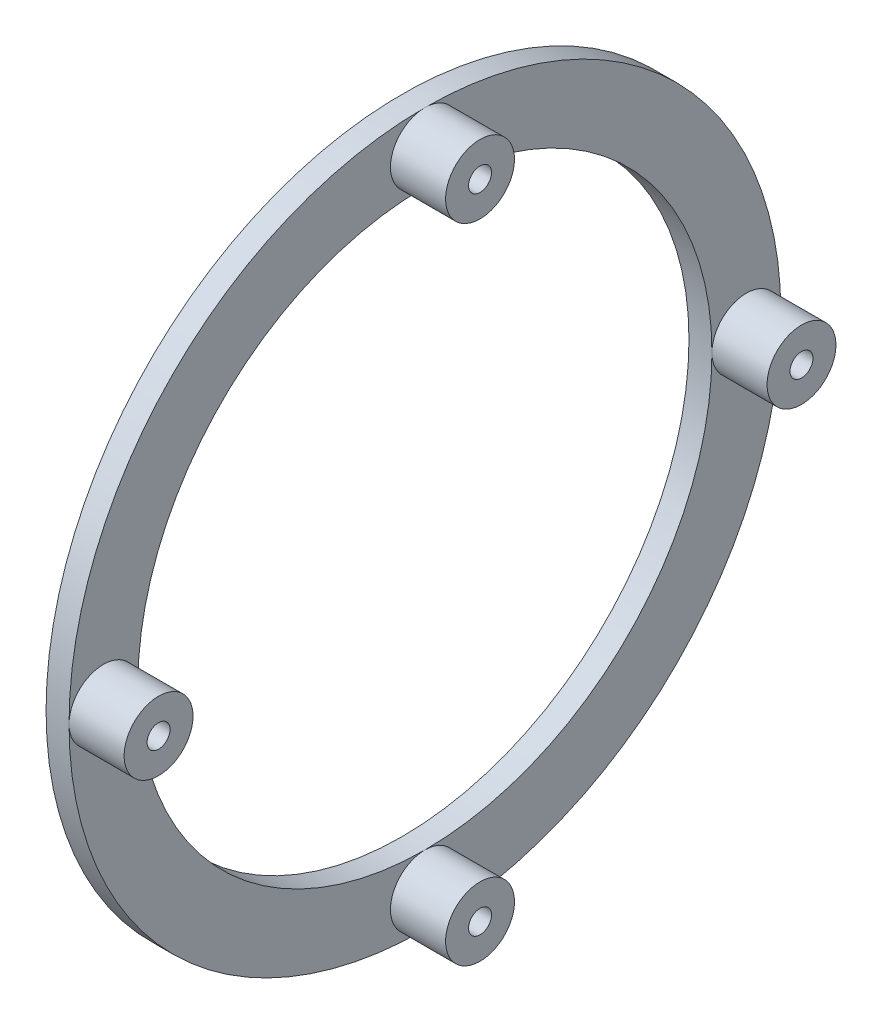
ISO-10303-21;
HEADER;
FILE_DESCRIPTION(('STEP AP214'),'2;1');
FILE_NAME('part.step','',(''),(''),'','','');
FILE_SCHEMA(('AUTOMOTIVE_DESIGN { 1 0 10303 214 1 1 1 1 }'));
ENDSEC;
DATA;
#1=APPLICATION_CONTEXT('core data for automotive mechanical design processes');
#2=APPLICATION_PROTOCOL_DEFINITION('international standard','automotive_design',2000,#1);
#3=PRODUCT_CONTEXT('',#1,'mechanical');
#4=PRODUCT('Part','Part','',(#3));
#5=PRODUCT_RELATED_PRODUCT_CATEGORY('part','',(#4));
#6=PRODUCT_DEFINITION_FORMATION('','',#4);
#7=PRODUCT_DEFINITION_CONTEXT('part definition',#1,'design');
#8=PRODUCT_DEFINITION('design','',#6,#7);
#9=PRODUCT_DEFINITION_SHAPE('','',#8);
#10=(LENGTH_UNIT() NAMED_UNIT(*) SI_UNIT(.MILLI.,.METRE.));
#11=(NAMED_UNIT(*) PLANE_ANGLE_UNIT() SI_UNIT($,.RADIAN.));
#12=(NAMED_UNIT(*) SI_UNIT($,.STERADIAN.) SOLID_ANGLE_UNIT());
#13=UNCERTAINTY_MEASURE_WITH_UNIT(LENGTH_MEASURE(1.E-05),#10,'distance_accuracy_value','');
#14=(GEOMETRIC_REPRESENTATION_CONTEXT(3) GLOBAL_UNCERTAINTY_ASSIGNED_CONTEXT((#13)) GLOBAL_UNIT_ASSIGNED_CONTEXT((#10,
#11,#12)) REPRESENTATION_CONTEXT('',''));
#15=CARTESIAN_POINT('',(0.,0.,0.));
#16=DIRECTION('',(0.,0.,1.));
#17=DIRECTION('',(1.,0.,0.));
#18=AXIS2_PLACEMENT_3D('',#15,#16,#17);
#19=CARTESIAN_POINT('',(6.35,0.,0.));
#20=DIRECTION('',(1.,0.,0.));
#21=DIRECTION('',(0.,0.,-1.));
#22=AXIS2_PLACEMENT_3D('',#19,#20,#21);
#23=PLANE('',#22);
#24=CARTESIAN_POINT('',(6.35,0.,0.));
#25=DIRECTION('',(1.,0.,0.));
#26=DIRECTION('',(0.,0.,-1.));
#27=AXIS2_PLACEMENT_3D('',#24,#25,#26);
#28=CIRCLE('',#27,98.425);
#29=CARTESIAN_POINT('',(6.35,0.,98.425));
#30=VERTEX_POINT('',#29);
#31=CARTESIAN_POINT('',(6.35,-98.425,-1.03094715232691E-12));
#32=VERTEX_POINT('',#31);
#33=EDGE_CURVE('E160',#30,#32,#28,.T.);
#34=ORIENTED_EDGE('',*,*,#33,.T.);
#35=CARTESIAN_POINT('',(6.35,-88.9,-9.31178073069464E-13));
#36=DIRECTION('',(1.,0.,0.));
#37=DIRECTION('',(0.,0.,-1.));
#38=AXIS2_PLACEMENT_3D('',#35,#36,#37);
#39=CIRCLE('',#38,9.52500000000001);
#40=CARTESIAN_POINT('',(6.35,-79.375,-8.31408993812021E-13));
#41=VERTEX_POINT('',#40);
#42=EDGE_CURVE('E55',#41,#32,#39,.T.);
#43=ORIENTED_EDGE('',*,*,#42,.F.);
#44=CARTESIAN_POINT('',(6.35,0.,0.));
#45=DIRECTION('',(1.,0.,0.));
#46=DIRECTION('',(0.,0.,-1.));
#47=AXIS2_PLACEMENT_3D('',#44,#45,#46);
#48=CIRCLE('',#47,79.375);
#49=CARTESIAN_POINT('',(6.35,0.,79.375));
#50=VERTEX_POINT('',#49);
#51=EDGE_CURVE('E210',#50,#41,#48,.T.);
#52=ORIENTED_EDGE('',*,*,#51,.F.);
#53=CARTESIAN_POINT('',(6.35,0.,88.9));
#54=DIRECTION('',(1.,0.,0.));
#55=DIRECTION('',(0.,0.,-1.));
#56=AXIS2_PLACEMENT_3D('',#53,#54,#55);
#57=CIRCLE('',#56,9.52500000000001);
#58=EDGE_CURVE('E62',#30,#50,#57,.T.);
#59=ORIENTED_EDGE('',*,*,#58,.F.);
#60=EDGE_LOOP('',(#34,#43,#52,#59));
#61=FACE_BOUND('',#60,.T.);
#62=ADVANCED_FACE('F38',(#61),#23,.T.);
#63=CARTESIAN_POINT('',(6.35,0.,-79.375));
#64=VERTEX_POINT('',#63);
#65=EDGE_CURVE('E150',#41,#64,#48,.T.);
#66=ORIENTED_EDGE('',*,*,#65,.F.);
#67=EDGE_CURVE('E119',#32,#41,#39,.T.);
#68=ORIENTED_EDGE('',*,*,#67,.F.);
#69=CARTESIAN_POINT('',(6.35,0.,-98.425));
#70=VERTEX_POINT('',#69);
#71=EDGE_CURVE('E154',#32,#70,#28,.T.);
#72=ORIENTED_EDGE('',*,*,#71,.T.);
#73=CARTESIAN_POINT('',(6.35,0.,-88.9));
#74=DIRECTION('',(1.,0.,0.));
#75=DIRECTION('',(0.,0.,-1.));
#76=AXIS2_PLACEMENT_3D('',#73,#74,#75);
#77=CIRCLE('',#76,9.52500000000001);
#78=EDGE_CURVE('E11',#64,#70,#77,.T.);
#79=ORIENTED_EDGE('',*,*,#78,.F.);
#80=EDGE_LOOP('',(#66,#68,#72,#79));
#81=FACE_BOUND('',#80,.T.);
#82=ADVANCED_FACE('F190',(#81),#23,.T.);
#83=CARTESIAN_POINT('',(6.35,98.425,3.43649050775635E-13));
#84=VERTEX_POINT('',#83);
#85=EDGE_CURVE('E153',#84,#30,#28,.T.);
#86=ORIENTED_EDGE('',*,*,#85,.T.);
#87=EDGE_CURVE('E128',#50,#30,#57,.T.);
#88=ORIENTED_EDGE('',*,*,#87,.F.);
#89=CARTESIAN_POINT('',(6.35,79.375,2.77136331270674E-13));
#90=VERTEX_POINT('',#89);
#91=EDGE_CURVE('E149',#90,#50,#48,.T.);
#92=ORIENTED_EDGE('',*,*,#91,.F.);
#93=CARTESIAN_POINT('',(6.35,88.9,3.10392691023155E-13));
#94=DIRECTION('',(1.,0.,0.));
#95=DIRECTION('',(0.,0.,-1.));
#96=AXIS2_PLACEMENT_3D('',#93,#94,#95);
#97=CIRCLE('',#96,9.52500000000001);
#98=EDGE_CURVE('E134',#84,#90,#97,.T.);
#99=ORIENTED_EDGE('',*,*,#98,.F.);
#100=EDGE_LOOP('',(#86,#88,#92,#99));
#101=FACE_BOUND('',#100,.T.);
#102=ADVANCED_FACE('F195',(#101),#23,.T.);
#103=EDGE_CURVE('E47',#70,#84,#28,.T.);
#104=ORIENTED_EDGE('',*,*,#103,.T.);
#105=EDGE_CURVE('E127',#90,#84,#97,.T.);
#106=ORIENTED_EDGE('',*,*,#105,.F.);
#107=EDGE_CURVE('E146',#64,#90,#48,.T.);
#108=ORIENTED_EDGE('',*,*,#107,.F.);
#109=EDGE_CURVE('E49',#70,#64,#77,.T.);
#110=ORIENTED_EDGE('',*,*,#109,.F.);
#111=EDGE_LOOP('',(#104,#106,#108,#110));
#112=FACE_BOUND('',#111,.T.);
#113=ADVANCED_FACE('F172',(#112),#23,.T.);
#114=CARTESIAN_POINT('',(0.,0.,0.));
#115=DIRECTION('',(1.,0.,0.));
#116=DIRECTION('',(0.,0.,-1.));
#117=AXIS2_PLACEMENT_3D('',#114,#115,#116);
#118=PLANE('',#117);
#119=CARTESIAN_POINT('',(0.,0.,0.));
#120=DIRECTION('',(1.,0.,0.));
#121=DIRECTION('',(0.,0.,-1.));
#122=AXIS2_PLACEMENT_3D('',#119,#120,#121);
#123=CIRCLE('',#122,98.425);
#124=CARTESIAN_POINT('',(0.,0.,-98.425));
#125=VERTEX_POINT('',#124);
#126=EDGE_CURVE('E42',#125,#125,#123,.T.);
#127=ORIENTED_EDGE('',*,*,#126,.F.);
#128=EDGE_LOOP('',(#127));
#129=FACE_BOUND('',#128,.T.);
#130=CARTESIAN_POINT('',(0.,0.,0.));
#131=DIRECTION('',(1.,0.,0.));
#132=DIRECTION('',(0.,0.,-1.));
#133=AXIS2_PLACEMENT_3D('',#130,#131,#132);
#134=CIRCLE('',#133,79.375);
#135=CARTESIAN_POINT('',(0.,0.,-79.375));
#136=VERTEX_POINT('',#135);
#137=EDGE_CURVE('E143',#136,#136,#134,.T.);
#138=ORIENTED_EDGE('',*,*,#137,.T.);
#139=EDGE_LOOP('',(#138));
#140=FACE_BOUND('',#139,.T.);
#141=ADVANCED_FACE('F169',(#129,#140),#118,.F.);
#142=CARTESIAN_POINT('',(6.35,0.,0.));
#143=DIRECTION('',(-1.,0.,0.));
#144=DIRECTION('',(0.,0.,1.));
#145=AXIS2_PLACEMENT_3D('',#142,#143,#144);
#146=CYLINDRICAL_SURFACE('',#145,98.425);
#147=ORIENTED_EDGE('',*,*,#103,.F.);
#148=ORIENTED_EDGE('',*,*,#71,.F.);
#149=ORIENTED_EDGE('',*,*,#33,.F.);
#150=ORIENTED_EDGE('',*,*,#85,.F.);
#151=EDGE_LOOP('',(#147,#148,#149,#150));
#152=FACE_BOUND('',#151,.T.);
#153=ORIENTED_EDGE('',*,*,#126,.T.);
#154=EDGE_LOOP('',(#153));
#155=FACE_BOUND('',#154,.T.);
#156=ADVANCED_FACE('F40',(#152,#155),#146,.T.);
#157=CARTESIAN_POINT('',(6.35,0.,0.));
#158=DIRECTION('',(-1.,0.,0.));
#159=DIRECTION('',(0.,0.,1.));
#160=AXIS2_PLACEMENT_3D('',#157,#158,#159);
#161=CYLINDRICAL_SURFACE('',#160,79.375);
#162=ORIENTED_EDGE('',*,*,#107,.T.);
#163=ORIENTED_EDGE('',*,*,#91,.T.);
#164=ORIENTED_EDGE('',*,*,#51,.T.);
#165=ORIENTED_EDGE('',*,*,#65,.T.);
#166=EDGE_LOOP('',(#162,#163,#164,#165));
#167=FACE_BOUND('',#166,.T.);
#168=ORIENTED_EDGE('',*,*,#137,.F.);
#169=EDGE_LOOP('',(#168));
#170=FACE_BOUND('',#169,.T.);
#171=ADVANCED_FACE('F175',(#167,#170),#161,.F.);
#172=CARTESIAN_POINT('',(21.59,0.,-88.9));
#173=DIRECTION('',(-1.,0.,0.));
#174=DIRECTION('',(0.,0.,1.));
#175=AXIS2_PLACEMENT_3D('',#172,#173,#174);
#176=CYLINDRICAL_SURFACE('',#175,9.52500000000001);
#177=CARTESIAN_POINT('',(21.59,0.,-88.9));
#178=DIRECTION('',(1.,0.,0.));
#179=DIRECTION('',(0.,0.,-1.));
#180=AXIS2_PLACEMENT_3D('',#177,#178,#179);
#181=CIRCLE('',#180,9.52500000000001);
#182=CARTESIAN_POINT('',(21.59,0.,-98.425));
#183=VERTEX_POINT('',#182);
#184=EDGE_CURVE('E141',#183,#183,#181,.T.);
#185=ORIENTED_EDGE('',*,*,#184,.F.);
#186=EDGE_LOOP('',(#185));
#187=FACE_BOUND('',#186,.T.);
#188=ORIENTED_EDGE('',*,*,#109,.T.);
#189=ORIENTED_EDGE('',*,*,#78,.T.);
#190=EDGE_LOOP('',(#188,#189));
#191=FACE_BOUND('',#190,.T.);
#192=ADVANCED_FACE('F177',(#187,#191),#176,.T.);
#193=CARTESIAN_POINT('',(21.59,0.,-88.9));
#194=DIRECTION('',(1.,0.,0.));
#195=DIRECTION('',(0.,0.,-1.));
#196=AXIS2_PLACEMENT_3D('',#193,#194,#195);
#197=PLANE('',#196);
#198=CARTESIAN_POINT('',(21.59,0.,-88.9));
#199=DIRECTION('',(1.,0.,0.));
#200=DIRECTION('',(0.,0.,-1.));
#201=AXIS2_PLACEMENT_3D('',#198,#199,#200);
#202=CIRCLE('',#201,3.175);
#203=CARTESIAN_POINT('',(21.59,0.,-92.075));
#204=VERTEX_POINT('',#203);
#205=EDGE_CURVE('E133',#204,#204,#202,.T.);
#206=ORIENTED_EDGE('',*,*,#205,.F.);
#207=EDGE_LOOP('',(#206));
#208=FACE_BOUND('',#207,.T.);
#209=ORIENTED_EDGE('',*,*,#184,.T.);
#210=EDGE_LOOP('',(#209));
#211=FACE_BOUND('',#210,.T.);
#212=ADVANCED_FACE('F184',(#208,#211),#197,.T.);
#213=CARTESIAN_POINT('',(8.89,0.,-88.9));
#214=DIRECTION('',(1.,0.,0.));
#215=DIRECTION('',(0.,0.,-1.));
#216=AXIS2_PLACEMENT_3D('',#213,#214,#215);
#217=CONICAL_SURFACE('',#216,3.175,1.02974425867665);
#218=CARTESIAN_POINT('',(6.98226753458749,0.,-88.9));
#219=VERTEX_POINT('',#218);
#220=VERTEX_LOOP('',#219);
#221=FACE_BOUND('',#220,.T.);
#222=CARTESIAN_POINT('',(8.89,0.,-88.9));
#223=DIRECTION('',(1.,0.,0.));
#224=DIRECTION('',(0.,0.,-1.));
#225=AXIS2_PLACEMENT_3D('',#222,#223,#224);
#226=CIRCLE('',#225,3.175);
#227=CARTESIAN_POINT('',(8.89,0.,-92.075));
#228=VERTEX_POINT('',#227);
#229=EDGE_CURVE('E138',#228,#228,#226,.T.);
#230=ORIENTED_EDGE('',*,*,#229,.T.);
#231=EDGE_LOOP('',(#230));
#232=FACE_BOUND('',#231,.T.);
#233=ADVANCED_FACE('F247',(#221,#232),#217,.F.);
#234=CARTESIAN_POINT('',(21.59,0.,-88.9));
#235=DIRECTION('',(1.,0.,0.));
#236=DIRECTION('',(0.,0.,-1.));
#237=AXIS2_PLACEMENT_3D('',#234,#235,#236);
#238=CYLINDRICAL_SURFACE('',#237,3.175);
#239=ORIENTED_EDGE('',*,*,#229,.F.);
#240=EDGE_LOOP('',(#239));
#241=FACE_BOUND('',#240,.T.);
#242=ORIENTED_EDGE('',*,*,#205,.T.);
#243=EDGE_LOOP('',(#242));
#244=FACE_BOUND('',#243,.T.);
#245=ADVANCED_FACE('F243',(#241,#244),#238,.F.);
#246=CARTESIAN_POINT('',(21.59,88.9,3.10392691023155E-13));
#247=DIRECTION('',(-1.,0.,0.));
#248=DIRECTION('',(0.,0.,1.));
#249=AXIS2_PLACEMENT_3D('',#246,#247,#248);
#250=CYLINDRICAL_SURFACE('',#249,9.52500000000001);
#251=CARTESIAN_POINT('',(21.59,88.9,3.10392691023155E-13));
#252=DIRECTION('',(1.,0.,0.));
#253=DIRECTION('',(0.,0.,-1.));
#254=AXIS2_PLACEMENT_3D('',#251,#252,#253);
#255=CIRCLE('',#254,9.52500000000001);
#256=CARTESIAN_POINT('',(21.59,88.9,-9.5249999999997));
#257=VERTEX_POINT('',#256);
#258=EDGE_CURVE('E130',#257,#257,#255,.T.);
#259=ORIENTED_EDGE('',*,*,#258,.F.);
#260=EDGE_LOOP('',(#259));
#261=FACE_BOUND('',#260,.T.);
#262=ORIENTED_EDGE('',*,*,#98,.T.);
#263=ORIENTED_EDGE('',*,*,#105,.T.);
#264=EDGE_LOOP('',(#262,#263));
#265=FACE_BOUND('',#264,.T.);
#266=ADVANCED_FACE('F239',(#261,#265),#250,.T.);
#267=CARTESIAN_POINT('',(21.59,88.9,3.10392691023155E-13));
#268=DIRECTION('',(1.,0.,0.));
#269=DIRECTION('',(0.,0.,-1.));
#270=AXIS2_PLACEMENT_3D('',#267,#268,#269);
#271=PLANE('',#270);
#272=CARTESIAN_POINT('',(21.59,88.9,3.10392691023155E-13));
#273=DIRECTION('',(1.,0.,0.));
#274=DIRECTION('',(0.,0.,-1.));
#275=AXIS2_PLACEMENT_3D('',#272,#273,#274);
#276=CIRCLE('',#275,3.175);
#277=CARTESIAN_POINT('',(21.59,88.9,-3.17499999999969));
#278=VERTEX_POINT('',#277);
#279=EDGE_CURVE('E113',#278,#278,#276,.T.);
#280=ORIENTED_EDGE('',*,*,#279,.F.);
#281=EDGE_LOOP('',(#280));
#282=FACE_BOUND('',#281,.T.);
#283=ORIENTED_EDGE('',*,*,#258,.T.);
#284=EDGE_LOOP('',(#283));
#285=FACE_BOUND('',#284,.T.);
#286=ADVANCED_FACE('F235',(#282,#285),#271,.T.);
#287=CARTESIAN_POINT('',(21.59,0.,88.9));
#288=DIRECTION('',(-1.,0.,0.));
#289=DIRECTION('',(0.,0.,1.));
#290=AXIS2_PLACEMENT_3D('',#287,#288,#289);
#291=CYLINDRICAL_SURFACE('',#290,9.52500000000001);
#292=CARTESIAN_POINT('',(21.59,0.,88.9));
#293=DIRECTION('',(1.,0.,0.));
#294=DIRECTION('',(0.,0.,-1.));
#295=AXIS2_PLACEMENT_3D('',#292,#293,#294);
#296=CIRCLE('',#295,9.52500000000001);
#297=CARTESIAN_POINT('',(21.59,0.,79.375));
#298=VERTEX_POINT('',#297);
#299=EDGE_CURVE('E124',#298,#298,#296,.T.);
#300=ORIENTED_EDGE('',*,*,#299,.F.);
#301=EDGE_LOOP('',(#300));
#302=FACE_BOUND('',#301,.T.);
#303=ORIENTED_EDGE('',*,*,#87,.T.);
#304=ORIENTED_EDGE('',*,*,#58,.T.);
#305=EDGE_LOOP('',(#303,#304));
#306=FACE_BOUND('',#305,.T.);
#307=ADVANCED_FACE('F227',(#302,#306),#291,.T.);
#308=CARTESIAN_POINT('',(21.59,0.,88.9));
#309=DIRECTION('',(1.,0.,0.));
#310=DIRECTION('',(0.,0.,-1.));
#311=AXIS2_PLACEMENT_3D('',#308,#309,#310);
#312=PLANE('',#311);
#313=CARTESIAN_POINT('',(21.59,0.,88.9));
#314=DIRECTION('',(1.,0.,0.));
#315=DIRECTION('',(0.,0.,-1.));
#316=AXIS2_PLACEMENT_3D('',#313,#314,#315);
#317=CIRCLE('',#316,3.175);
#318=CARTESIAN_POINT('',(21.59,0.,85.725));
#319=VERTEX_POINT('',#318);
#320=EDGE_CURVE('E102',#319,#319,#317,.T.);
#321=ORIENTED_EDGE('',*,*,#320,.F.);
#322=EDGE_LOOP('',(#321));
#323=FACE_BOUND('',#322,.T.);
#324=ORIENTED_EDGE('',*,*,#299,.T.);
#325=EDGE_LOOP('',(#324));
#326=FACE_BOUND('',#325,.T.);
#327=ADVANCED_FACE('F217',(#323,#326),#312,.T.);
#328=CARTESIAN_POINT('',(21.59,-88.9,-9.31178073069464E-13));
#329=DIRECTION('',(-1.,0.,0.));
#330=DIRECTION('',(0.,0.,1.));
#331=AXIS2_PLACEMENT_3D('',#328,#329,#330);
#332=CYLINDRICAL_SURFACE('',#331,9.52500000000001);
#333=CARTESIAN_POINT('',(21.59,-88.9,-9.31178073069464E-13));
#334=DIRECTION('',(1.,0.,0.));
#335=DIRECTION('',(0.,0.,-1.));
#336=AXIS2_PLACEMENT_3D('',#333,#334,#335);
#337=CIRCLE('',#336,9.52500000000001);
#338=CARTESIAN_POINT('',(21.59,-88.9,-9.52500000000094));
#339=VERTEX_POINT('',#338);
#340=EDGE_CURVE('E120',#339,#339,#337,.T.);
#341=ORIENTED_EDGE('',*,*,#340,.F.);
#342=EDGE_LOOP('',(#341));
#343=FACE_BOUND('',#342,.T.);
#344=ORIENTED_EDGE('',*,*,#42,.T.);
#345=ORIENTED_EDGE('',*,*,#67,.T.);
#346=EDGE_LOOP('',(#344,#345));
#347=FACE_BOUND('',#346,.T.);
#348=ADVANCED_FACE('F214',(#343,#347),#332,.T.);
#349=CARTESIAN_POINT('',(21.59,-88.9,-9.31178073069464E-13));
#350=DIRECTION('',(1.,0.,0.));
#351=DIRECTION('',(0.,0.,-1.));
#352=AXIS2_PLACEMENT_3D('',#349,#350,#351);
#353=PLANE('',#352);
#354=CARTESIAN_POINT('',(21.59,-88.9,-9.31178073069464E-13));
#355=DIRECTION('',(1.,0.,0.));
#356=DIRECTION('',(0.,0.,-1.));
#357=AXIS2_PLACEMENT_3D('',#354,#355,#356);
#358=CIRCLE('',#357,3.175);
#359=CARTESIAN_POINT('',(21.59,-88.9,-3.17500000000093));
#360=VERTEX_POINT('',#359);
#361=EDGE_CURVE('E103',#360,#360,#358,.T.);
#362=ORIENTED_EDGE('',*,*,#361,.F.);
#363=EDGE_LOOP('',(#362));
#364=FACE_BOUND('',#363,.T.);
#365=ORIENTED_EDGE('',*,*,#340,.T.);
#366=EDGE_LOOP('',(#365));
#367=FACE_BOUND('',#366,.T.);
#368=ADVANCED_FACE('F216',(#364,#367),#353,.T.);
#369=CARTESIAN_POINT('',(8.89,88.9,3.10392691023155E-13));
#370=DIRECTION('',(1.,0.,0.));
#371=DIRECTION('',(0.,0.,-1.));
#372=AXIS2_PLACEMENT_3D('',#369,#370,#371);
#373=CONICAL_SURFACE('',#372,3.175,1.02974425867665);
#374=CARTESIAN_POINT('',(6.98226753458749,88.9,3.10392691023155E-13));
#375=VERTEX_POINT('',#374);
#376=VERTEX_LOOP('',#375);
#377=FACE_BOUND('',#376,.T.);
#378=CARTESIAN_POINT('',(8.89,88.9,3.10392691023155E-13));
#379=DIRECTION('',(1.,0.,0.));
#380=DIRECTION('',(0.,0.,-1.));
#381=AXIS2_PLACEMENT_3D('',#378,#379,#380);
#382=CIRCLE('',#381,3.175);
#383=CARTESIAN_POINT('',(8.89,88.9,-3.17499999999969));
#384=VERTEX_POINT('',#383);
#385=EDGE_CURVE('E116',#384,#384,#382,.T.);
#386=ORIENTED_EDGE('',*,*,#385,.T.);
#387=EDGE_LOOP('',(#386));
#388=FACE_BOUND('',#387,.T.);
#389=ADVANCED_FACE('F224',(#377,#388),#373,.F.);
#390=CARTESIAN_POINT('',(21.59,88.9,3.10392691023155E-13));
#391=DIRECTION('',(1.,0.,0.));
#392=DIRECTION('',(0.,0.,-1.));
#393=AXIS2_PLACEMENT_3D('',#390,#391,#392);
#394=CYLINDRICAL_SURFACE('',#393,3.175);
#395=ORIENTED_EDGE('',*,*,#385,.F.);
#396=EDGE_LOOP('',(#395));
#397=FACE_BOUND('',#396,.T.);
#398=ORIENTED_EDGE('',*,*,#279,.T.);
#399=EDGE_LOOP('',(#398));
#400=FACE_BOUND('',#399,.T.);
#401=ADVANCED_FACE('F303',(#397,#400),#394,.F.);
#402=CARTESIAN_POINT('',(8.89,0.,88.9));
#403=DIRECTION('',(1.,0.,0.));
#404=DIRECTION('',(0.,0.,-1.));
#405=AXIS2_PLACEMENT_3D('',#402,#403,#404);
#406=CONICAL_SURFACE('',#405,3.175,1.02974425867665);
#407=CARTESIAN_POINT('',(6.98226753458749,0.,88.9));
#408=VERTEX_POINT('',#407);
#409=VERTEX_LOOP('',#408);
#410=FACE_BOUND('',#409,.T.);
#411=CARTESIAN_POINT('',(8.89,0.,88.9));
#412=DIRECTION('',(1.,0.,0.));
#413=DIRECTION('',(0.,0.,-1.));
#414=AXIS2_PLACEMENT_3D('',#411,#412,#413);
#415=CIRCLE('',#414,3.175);
#416=CARTESIAN_POINT('',(8.89,0.,85.725));
#417=VERTEX_POINT('',#416);
#418=EDGE_CURVE('E106',#417,#417,#415,.T.);
#419=ORIENTED_EDGE('',*,*,#418,.T.);
#420=EDGE_LOOP('',(#419));
#421=FACE_BOUND('',#420,.T.);
#422=ADVANCED_FACE('F311',(#410,#421),#406,.F.);
#423=CARTESIAN_POINT('',(21.59,0.,88.9));
#424=DIRECTION('',(1.,0.,0.));
#425=DIRECTION('',(0.,0.,-1.));
#426=AXIS2_PLACEMENT_3D('',#423,#424,#425);
#427=CYLINDRICAL_SURFACE('',#426,3.175);
#428=ORIENTED_EDGE('',*,*,#418,.F.);
#429=EDGE_LOOP('',(#428));
#430=FACE_BOUND('',#429,.T.);
#431=ORIENTED_EDGE('',*,*,#320,.T.);
#432=EDGE_LOOP('',(#431));
#433=FACE_BOUND('',#432,.T.);
#434=ADVANCED_FACE('F96',(#430,#433),#427,.F.);
#435=CARTESIAN_POINT('',(8.89,-88.9,-9.31178073069464E-13));
#436=DIRECTION('',(1.,0.,0.));
#437=DIRECTION('',(0.,0.,-1.));
#438=AXIS2_PLACEMENT_3D('',#435,#436,#437);
#439=CONICAL_SURFACE('',#438,3.175,1.02974425867665);
#440=CARTESIAN_POINT('',(6.98226753458749,-88.9,-9.31178073069464E-13));
#441=VERTEX_POINT('',#440);
#442=VERTEX_LOOP('',#441);
#443=FACE_BOUND('',#442,.T.);
#444=CARTESIAN_POINT('',(8.89,-88.9,-9.31178073069464E-13));
#445=DIRECTION('',(1.,0.,0.));
#446=DIRECTION('',(0.,0.,-1.));
#447=AXIS2_PLACEMENT_3D('',#444,#445,#446);
#448=CIRCLE('',#447,3.175);
#449=CARTESIAN_POINT('',(8.89,-88.9,-3.17500000000093));
#450=VERTEX_POINT('',#449);
#451=EDGE_CURVE('E100',#450,#450,#448,.T.);
#452=ORIENTED_EDGE('',*,*,#451,.T.);
#453=EDGE_LOOP('',(#452));
#454=FACE_BOUND('',#453,.T.);
#455=ADVANCED_FACE('F92',(#443,#454),#439,.F.);
#456=CARTESIAN_POINT('',(21.59,-88.9,-9.31178073069464E-13));
#457=DIRECTION('',(1.,0.,0.));
#458=DIRECTION('',(0.,0.,-1.));
#459=AXIS2_PLACEMENT_3D('',#456,#457,#458);
#460=CYLINDRICAL_SURFACE('',#459,3.175);
#461=ORIENTED_EDGE('',*,*,#451,.F.);
#462=EDGE_LOOP('',(#461));
#463=FACE_BOUND('',#462,.T.);
#464=ORIENTED_EDGE('',*,*,#361,.T.);
#465=EDGE_LOOP('',(#464));
#466=FACE_BOUND('',#465,.T.);
#467=ADVANCED_FACE('F95',(#463,#466),#460,.F.);
#468=CLOSED_SHELL('',(#62,#82,#102,#113,#141,#156,#171,#192,#212,#233,#245,#266,#286,#307,#327,
#348,#368,#389,#401,#422,#434,#455,#467));
#469=MANIFOLD_SOLID_BREP('B2',#468);
#470=ADVANCED_BREP_SHAPE_REPRESENTATION('',(#18,#469),#14);
#471=SHAPE_DEFINITION_REPRESENTATION(#9,#470);
ENDSEC;
END-ISO-10303-21;
